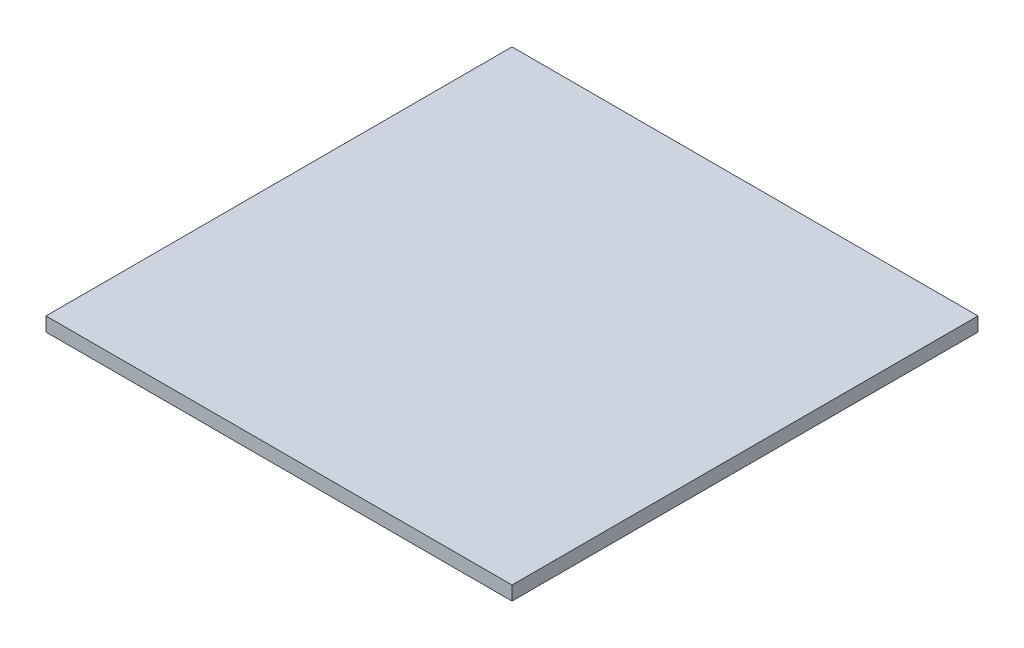
ISO-10303-21;
HEADER;
FILE_DESCRIPTION(('STEP AP214'),'2;1');
FILE_NAME('part.step','',(''),(''),'','','');
FILE_SCHEMA(('AUTOMOTIVE_DESIGN { 1 0 10303 214 1 1 1 1 }'));
ENDSEC;
DATA;
#1=APPLICATION_CONTEXT('core data for automotive mechanical design processes');
#2=APPLICATION_PROTOCOL_DEFINITION('international standard','automotive_design',2000,#1);
#3=PRODUCT_CONTEXT('',#1,'mechanical');
#4=PRODUCT('Part','Part','',(#3));
#5=PRODUCT_RELATED_PRODUCT_CATEGORY('part','',(#4));
#6=PRODUCT_DEFINITION_FORMATION('','',#4);
#7=PRODUCT_DEFINITION_CONTEXT('part definition',#1,'design');
#8=PRODUCT_DEFINITION('design','',#6,#7);
#9=PRODUCT_DEFINITION_SHAPE('','',#8);
#10=(LENGTH_UNIT() NAMED_UNIT(*) SI_UNIT(.MILLI.,.METRE.));
#11=(NAMED_UNIT(*) PLANE_ANGLE_UNIT() SI_UNIT($,.RADIAN.));
#12=(NAMED_UNIT(*) SI_UNIT($,.STERADIAN.) SOLID_ANGLE_UNIT());
#13=UNCERTAINTY_MEASURE_WITH_UNIT(LENGTH_MEASURE(1.E-05),#10,'distance_accuracy_value','');
#14=(GEOMETRIC_REPRESENTATION_CONTEXT(3) GLOBAL_UNCERTAINTY_ASSIGNED_CONTEXT((#13)) GLOBAL_UNIT_ASSIGNED_CONTEXT((#10,
#11,#12)) REPRESENTATION_CONTEXT('',''));
#15=CARTESIAN_POINT('',(0.,0.,0.));
#16=DIRECTION('',(0.,0.,1.));
#17=DIRECTION('',(1.,0.,0.));
#18=AXIS2_PLACEMENT_3D('',#15,#16,#17);
#19=CARTESIAN_POINT('',(-50.,3.,50.));
#20=DIRECTION('',(1.,0.,0.));
#21=DIRECTION('',(0.,0.,-1.));
#22=AXIS2_PLACEMENT_3D('',#19,#20,#21);
#23=PLANE('',#22);
#24=DIRECTION('',(0.,0.,1.));
#25=VECTOR('',#24,1.);
#26=CARTESIAN_POINT('',(-50.,0.,50.));
#27=LINE('',#26,#25);
#28=CARTESIAN_POINT('',(-50.,0.,-50.));
#29=VERTEX_POINT('',#28);
#30=CARTESIAN_POINT('',(-50.,0.,50.));
#31=VERTEX_POINT('',#30);
#32=EDGE_CURVE('E96',#29,#31,#27,.T.);
#33=ORIENTED_EDGE('',*,*,#32,.T.);
#34=DIRECTION('',(0.,-1.,0.));
#35=VECTOR('',#34,1.);
#36=CARTESIAN_POINT('',(-50.,3.,50.));
#37=LINE('',#36,#35);
#38=CARTESIAN_POINT('',(-50.,3.,50.));
#39=VERTEX_POINT('',#38);
#40=EDGE_CURVE('E11',#39,#31,#37,.T.);
#41=ORIENTED_EDGE('',*,*,#40,.F.);
#42=DIRECTION('',(0.,0.,1.));
#43=VECTOR('',#42,1.);
#44=CARTESIAN_POINT('',(-50.,3.,50.));
#45=LINE('',#44,#43);
#46=CARTESIAN_POINT('',(-50.,3.,-50.));
#47=VERTEX_POINT('',#46);
#48=EDGE_CURVE('E84',#47,#39,#45,.T.);
#49=ORIENTED_EDGE('',*,*,#48,.F.);
#50=DIRECTION('',(0.,-1.,0.));
#51=VECTOR('',#50,1.);
#52=CARTESIAN_POINT('',(-50.,3.,-50.));
#53=LINE('',#52,#51);
#54=EDGE_CURVE('E92',#47,#29,#53,.T.);
#55=ORIENTED_EDGE('',*,*,#54,.T.);
#56=EDGE_LOOP('',(#33,#41,#49,#55));
#57=FACE_BOUND('',#56,.T.);
#58=ADVANCED_FACE('F33',(#57),#23,.F.);
#59=CARTESIAN_POINT('',(50.,3.,50.));
#60=DIRECTION('',(0.,0.,-1.));
#61=DIRECTION('',(-1.,0.,0.));
#62=AXIS2_PLACEMENT_3D('',#59,#60,#61);
#63=PLANE('',#62);
#64=DIRECTION('',(1.,0.,0.));
#65=VECTOR('',#64,1.);
#66=CARTESIAN_POINT('',(50.,0.,50.));
#67=LINE('',#66,#65);
#68=CARTESIAN_POINT('',(50.,0.,50.));
#69=VERTEX_POINT('',#68);
#70=EDGE_CURVE('E88',#31,#69,#67,.T.);
#71=ORIENTED_EDGE('',*,*,#70,.T.);
#72=DIRECTION('',(0.,-1.,0.));
#73=VECTOR('',#72,1.);
#74=CARTESIAN_POINT('',(50.,3.,50.));
#75=LINE('',#74,#73);
#76=CARTESIAN_POINT('',(50.,3.,50.));
#77=VERTEX_POINT('',#76);
#78=EDGE_CURVE('E41',#77,#69,#75,.T.);
#79=ORIENTED_EDGE('',*,*,#78,.F.);
#80=DIRECTION('',(1.,0.,0.));
#81=VECTOR('',#80,1.);
#82=CARTESIAN_POINT('',(50.,3.,50.));
#83=LINE('',#82,#81);
#84=EDGE_CURVE('E79',#39,#77,#83,.T.);
#85=ORIENTED_EDGE('',*,*,#84,.F.);
#86=ORIENTED_EDGE('',*,*,#40,.T.);
#87=EDGE_LOOP('',(#71,#79,#85,#86));
#88=FACE_BOUND('',#87,.T.);
#89=ADVANCED_FACE('F87',(#88),#63,.F.);
#90=CARTESIAN_POINT('',(50.,3.,50.));
#91=DIRECTION('',(-1.,0.,0.));
#92=DIRECTION('',(0.,0.,1.));
#93=AXIS2_PLACEMENT_3D('',#90,#91,#92);
#94=PLANE('',#93);
#95=DIRECTION('',(0.,0.,-1.));
#96=VECTOR('',#95,1.);
#97=CARTESIAN_POINT('',(50.,0.,50.));
#98=LINE('',#97,#96);
#99=CARTESIAN_POINT('',(50.,0.,-50.));
#100=VERTEX_POINT('',#99);
#101=EDGE_CURVE('E66',#69,#100,#98,.T.);
#102=ORIENTED_EDGE('',*,*,#101,.T.);
#103=DIRECTION('',(0.,-1.,0.));
#104=VECTOR('',#103,1.);
#105=CARTESIAN_POINT('',(50.,3.,-50.));
#106=LINE('',#105,#104);
#107=CARTESIAN_POINT('',(50.,3.,-50.));
#108=VERTEX_POINT('',#107);
#109=EDGE_CURVE('E89',#108,#100,#106,.T.);
#110=ORIENTED_EDGE('',*,*,#109,.F.);
#111=DIRECTION('',(0.,0.,-1.));
#112=VECTOR('',#111,1.);
#113=CARTESIAN_POINT('',(50.,3.,50.));
#114=LINE('',#113,#112);
#115=EDGE_CURVE('E82',#77,#108,#114,.T.);
#116=ORIENTED_EDGE('',*,*,#115,.F.);
#117=ORIENTED_EDGE('',*,*,#78,.T.);
#118=EDGE_LOOP('',(#102,#110,#116,#117));
#119=FACE_BOUND('',#118,.T.);
#120=ADVANCED_FACE('F90',(#119),#94,.F.);
#121=CARTESIAN_POINT('',(50.,3.,-50.));
#122=DIRECTION('',(0.,0.,1.));
#123=DIRECTION('',(1.,0.,0.));
#124=AXIS2_PLACEMENT_3D('',#121,#122,#123);
#125=PLANE('',#124);
#126=DIRECTION('',(-1.,0.,0.));
#127=VECTOR('',#126,1.);
#128=CARTESIAN_POINT('',(50.,0.,-50.));
#129=LINE('',#128,#127);
#130=EDGE_CURVE('E72',#100,#29,#129,.T.);
#131=ORIENTED_EDGE('',*,*,#130,.T.);
#132=ORIENTED_EDGE('',*,*,#54,.F.);
#133=DIRECTION('',(-1.,0.,0.));
#134=VECTOR('',#133,1.);
#135=CARTESIAN_POINT('',(50.,3.,-50.));
#136=LINE('',#135,#134);
#137=EDGE_CURVE('E49',#108,#47,#136,.T.);
#138=ORIENTED_EDGE('',*,*,#137,.F.);
#139=ORIENTED_EDGE('',*,*,#109,.T.);
#140=EDGE_LOOP('',(#131,#132,#138,#139));
#141=FACE_BOUND('',#140,.T.);
#142=ADVANCED_FACE('F103',(#141),#125,.F.);
#143=CARTESIAN_POINT('',(0.,3.,0.));
#144=DIRECTION('',(0.,1.,0.));
#145=DIRECTION('',(0.,0.,1.));
#146=AXIS2_PLACEMENT_3D('',#143,#144,#145);
#147=PLANE('',#146);
#148=ORIENTED_EDGE('',*,*,#48,.T.);
#149=ORIENTED_EDGE('',*,*,#84,.T.);
#150=ORIENTED_EDGE('',*,*,#115,.T.);
#151=ORIENTED_EDGE('',*,*,#137,.T.);
#152=EDGE_LOOP('',(#148,#149,#150,#151));
#153=FACE_BOUND('',#152,.T.);
#154=ADVANCED_FACE('F80',(#153),#147,.T.);
#155=CARTESIAN_POINT('',(0.,0.,0.));
#156=DIRECTION('',(0.,1.,0.));
#157=DIRECTION('',(0.,0.,1.));
#158=AXIS2_PLACEMENT_3D('',#155,#156,#157);
#159=PLANE('',#158);
#160=ORIENTED_EDGE('',*,*,#32,.F.);
#161=ORIENTED_EDGE('',*,*,#130,.F.);
#162=ORIENTED_EDGE('',*,*,#101,.F.);
#163=ORIENTED_EDGE('',*,*,#70,.F.);
#164=EDGE_LOOP('',(#160,#161,#162,#163));
#165=FACE_BOUND('',#164,.T.);
#166=ADVANCED_FACE('F106',(#165),#159,.F.);
#167=CLOSED_SHELL('',(#58,#89,#120,#142,#154,#166));
#168=MANIFOLD_SOLID_BREP('B2',#167);
#169=ADVANCED_BREP_SHAPE_REPRESENTATION('',(#18,#168),#14);
#170=SHAPE_DEFINITION_REPRESENTATION(#9,#169);
ENDSEC;
END-ISO-10303-21;
